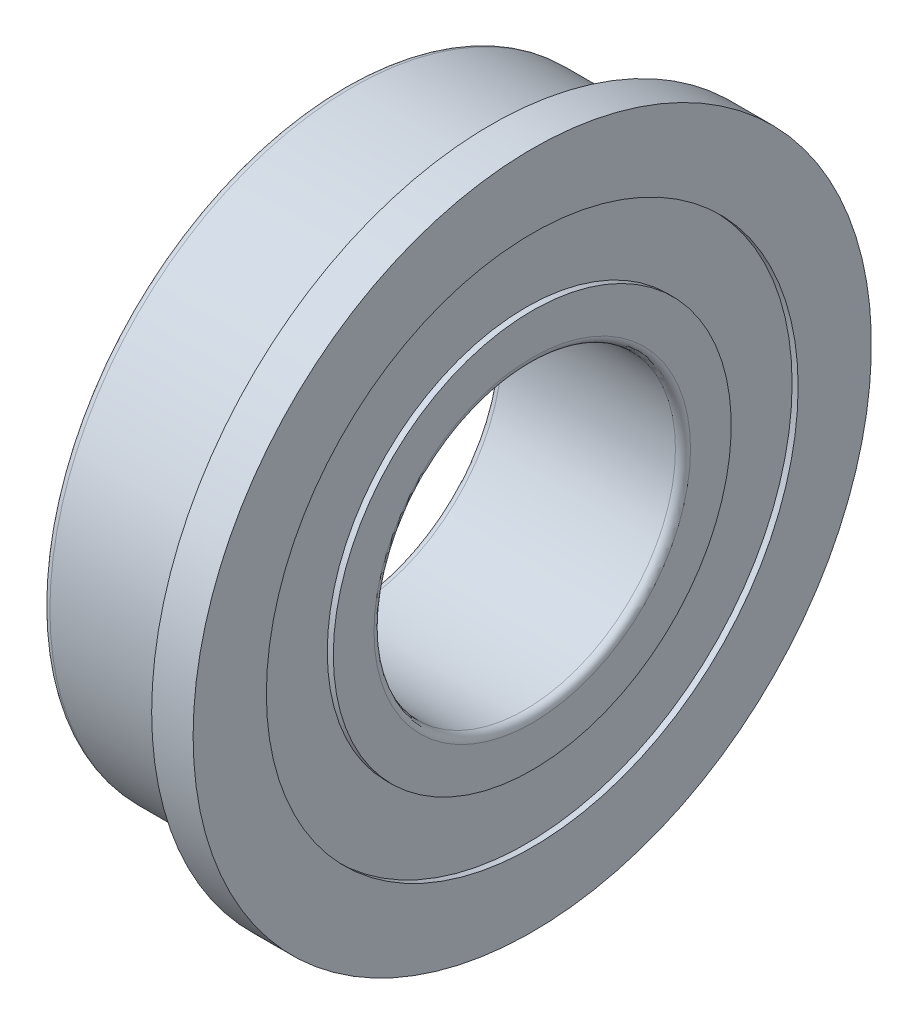
ISO-10303-21;
HEADER;
FILE_DESCRIPTION(('STEP AP214'),'2;1');
FILE_NAME('part.step','',(''),(''),'','','');
FILE_SCHEMA(('AUTOMOTIVE_DESIGN { 1 0 10303 214 1 1 1 1 }'));
ENDSEC;
DATA;
#1=APPLICATION_CONTEXT('core data for automotive mechanical design processes');
#2=APPLICATION_PROTOCOL_DEFINITION('international standard','automotive_design',2000,#1);
#3=PRODUCT_CONTEXT('',#1,'mechanical');
#4=PRODUCT('Part','Part','',(#3));
#5=PRODUCT_RELATED_PRODUCT_CATEGORY('part','',(#4));
#6=PRODUCT_DEFINITION_FORMATION('','',#4);
#7=PRODUCT_DEFINITION_CONTEXT('part definition',#1,'design');
#8=PRODUCT_DEFINITION('design','',#6,#7);
#9=PRODUCT_DEFINITION_SHAPE('','',#8);
#10=(LENGTH_UNIT() NAMED_UNIT(*) SI_UNIT(.MILLI.,.METRE.));
#11=(NAMED_UNIT(*) PLANE_ANGLE_UNIT() SI_UNIT($,.RADIAN.));
#12=(NAMED_UNIT(*) SI_UNIT($,.STERADIAN.) SOLID_ANGLE_UNIT());
#13=UNCERTAINTY_MEASURE_WITH_UNIT(LENGTH_MEASURE(1.E-05),#10,'distance_accuracy_value','');
#14=(GEOMETRIC_REPRESENTATION_CONTEXT(3) GLOBAL_UNCERTAINTY_ASSIGNED_CONTEXT((#13)) GLOBAL_UNIT_ASSIGNED_CONTEXT((#10,
#11,#12)) REPRESENTATION_CONTEXT('',''));
#15=CARTESIAN_POINT('',(0.,0.,0.));
#16=DIRECTION('',(0.,0.,1.));
#17=DIRECTION('',(1.,0.,0.));
#18=AXIS2_PLACEMENT_3D('',#15,#16,#17);
#19=CARTESIAN_POINT('',(0.,-5.35122517363639,-5.28));
#20=DIRECTION('',(-1.,0.,0.));
#21=DIRECTION('',(0.,0.,1.));
#22=AXIS2_PLACEMENT_3D('',#19,#20,#21);
#23=PLANE('',#22);
#24=CARTESIAN_POINT('',(0.,0.,0.));
#25=DIRECTION('',(-1.,0.,0.));
#26=DIRECTION('',(0.,0.,-1.));
#27=AXIS2_PLACEMENT_3D('',#24,#25,#26);
#28=CIRCLE('',#27,5.28);
#29=CARTESIAN_POINT('',(0.,0.,-5.28));
#30=VERTEX_POINT('',#29);
#31=EDGE_CURVE('E92',#30,#30,#28,.F.);
#32=ORIENTED_EDGE('',*,*,#31,.F.);
#33=EDGE_LOOP('',(#32));
#34=FACE_BOUND('',#33,.T.);
#35=CARTESIAN_POINT('',(0.,0.,0.));
#36=DIRECTION('',(1.,0.,0.));
#37=DIRECTION('',(0.,0.,1.));
#38=AXIS2_PLACEMENT_3D('',#35,#36,#37);
#39=CIRCLE('',#38,4.2);
#40=CARTESIAN_POINT('',(0.,0.,4.2));
#41=VERTEX_POINT('',#40);
#42=EDGE_CURVE('E88',#41,#41,#39,.T.);
#43=ORIENTED_EDGE('',*,*,#42,.T.);
#44=EDGE_LOOP('',(#43));
#45=FACE_BOUND('',#44,.T.);
#46=ADVANCED_FACE('F15',(#34,#45),#23,.T.);
#47=CARTESIAN_POINT('',(5.,-5.35122517363636,5.28));
#48=DIRECTION('',(1.,0.,0.));
#49=DIRECTION('',(0.,0.,-1.));
#50=AXIS2_PLACEMENT_3D('',#47,#48,#49);
#51=PLANE('',#50);
#52=CARTESIAN_POINT('',(5.,0.,0.));
#53=DIRECTION('',(1.,0.,0.));
#54=DIRECTION('',(0.,0.,1.));
#55=AXIS2_PLACEMENT_3D('',#52,#53,#54);
#56=CIRCLE('',#55,5.28);
#57=CARTESIAN_POINT('',(5.,0.,5.28));
#58=VERTEX_POINT('',#57);
#59=EDGE_CURVE('E84',#58,#58,#56,.T.);
#60=ORIENTED_EDGE('',*,*,#59,.T.);
#61=EDGE_LOOP('',(#60));
#62=FACE_BOUND('',#61,.T.);
#63=CARTESIAN_POINT('',(5.,0.,0.));
#64=DIRECTION('',(-1.,0.,0.));
#65=DIRECTION('',(0.,0.,-1.));
#66=AXIS2_PLACEMENT_3D('',#63,#64,#65);
#67=CIRCLE('',#66,4.20000011099115);
#68=CARTESIAN_POINT('',(5.,0.,-4.20000011099115));
#69=VERTEX_POINT('',#68);
#70=EDGE_CURVE('E80',#69,#69,#67,.F.);
#71=ORIENTED_EDGE('',*,*,#70,.F.);
#72=EDGE_LOOP('',(#71));
#73=FACE_BOUND('',#72,.T.);
#74=ADVANCED_FACE('F101',(#62,#73),#51,.T.);
#75=CARTESIAN_POINT('',(4.84,-7.24879784524055,7.056));
#76=DIRECTION('',(1.,0.,0.));
#77=DIRECTION('',(0.,0.,-1.));
#78=AXIS2_PLACEMENT_3D('',#75,#76,#77);
#79=PLANE('',#78);
#80=CARTESIAN_POINT('',(4.84,0.,0.));
#81=DIRECTION('',(1.,0.,0.));
#82=DIRECTION('',(0.,0.,1.));
#83=AXIS2_PLACEMENT_3D('',#80,#81,#82);
#84=CIRCLE('',#83,7.056);
#85=CARTESIAN_POINT('',(4.84,0.,7.056));
#86=VERTEX_POINT('',#85);
#87=EDGE_CURVE('E76',#86,#86,#84,.T.);
#88=ORIENTED_EDGE('',*,*,#87,.T.);
#89=EDGE_LOOP('',(#88));
#90=FACE_BOUND('',#89,.T.);
#91=CARTESIAN_POINT('',(4.84,0.,0.));
#92=DIRECTION('',(-1.,0.,0.));
#93=DIRECTION('',(0.,0.,-1.));
#94=AXIS2_PLACEMENT_3D('',#91,#92,#93);
#95=CIRCLE('',#94,5.28);
#96=CARTESIAN_POINT('',(4.84,0.,-5.28));
#97=VERTEX_POINT('',#96);
#98=EDGE_CURVE('E72',#97,#97,#95,.F.);
#99=ORIENTED_EDGE('',*,*,#98,.F.);
#100=EDGE_LOOP('',(#99));
#101=FACE_BOUND('',#100,.T.);
#102=ADVANCED_FACE('F169',(#90,#101),#79,.T.);
#103=CARTESIAN_POINT('',(5.,-9.24591561892927,9.));
#104=DIRECTION('',(1.,0.,0.));
#105=DIRECTION('',(0.,0.,-1.));
#106=AXIS2_PLACEMENT_3D('',#103,#104,#105);
#107=PLANE('',#106);
#108=CARTESIAN_POINT('',(5.,0.,0.));
#109=DIRECTION('',(1.,0.,0.));
#110=DIRECTION('',(0.,0.,1.));
#111=AXIS2_PLACEMENT_3D('',#108,#109,#110);
#112=CIRCLE('',#111,9.);
#113=CARTESIAN_POINT('',(5.,0.,9.));
#114=VERTEX_POINT('',#113);
#115=EDGE_CURVE('E68',#114,#114,#112,.T.);
#116=ORIENTED_EDGE('',*,*,#115,.T.);
#117=EDGE_LOOP('',(#116));
#118=FACE_BOUND('',#117,.T.);
#119=CARTESIAN_POINT('',(5.,0.,0.));
#120=DIRECTION('',(-1.,0.,0.));
#121=DIRECTION('',(0.,0.,-1.));
#122=AXIS2_PLACEMENT_3D('',#119,#120,#121);
#123=CIRCLE('',#122,7.056);
#124=CARTESIAN_POINT('',(5.,0.,-7.056));
#125=VERTEX_POINT('',#124);
#126=EDGE_CURVE('E64',#125,#125,#123,.F.);
#127=ORIENTED_EDGE('',*,*,#126,.F.);
#128=EDGE_LOOP('',(#127));
#129=FACE_BOUND('',#128,.T.);
#130=ADVANCED_FACE('F162',(#118,#129),#107,.T.);
#131=CARTESIAN_POINT('',(3.9,-9.24591561892927,-9.));
#132=DIRECTION('',(-1.,0.,0.));
#133=DIRECTION('',(0.,0.,1.));
#134=AXIS2_PLACEMENT_3D('',#131,#132,#133);
#135=PLANE('',#134);
#136=CARTESIAN_POINT('',(3.9,0.,0.));
#137=DIRECTION('',(-1.,0.,0.));
#138=DIRECTION('',(0.,0.,-1.));
#139=AXIS2_PLACEMENT_3D('',#136,#137,#138);
#140=CIRCLE('',#139,9.);
#141=CARTESIAN_POINT('',(3.9,0.,-9.));
#142=VERTEX_POINT('',#141);
#143=EDGE_CURVE('E60',#142,#142,#140,.F.);
#144=ORIENTED_EDGE('',*,*,#143,.F.);
#145=EDGE_LOOP('',(#144));
#146=FACE_BOUND('',#145,.T.);
#147=CARTESIAN_POINT('',(3.9,0.,0.));
#148=DIRECTION('',(1.,0.,0.));
#149=DIRECTION('',(0.,0.,1.));
#150=AXIS2_PLACEMENT_3D('',#147,#148,#149);
#151=CIRCLE('',#150,8.19999999999999);
#152=CARTESIAN_POINT('',(3.9,0.,8.19999999999999));
#153=VERTEX_POINT('',#152);
#154=EDGE_CURVE('E56',#153,#153,#151,.T.);
#155=ORIENTED_EDGE('',*,*,#154,.T.);
#156=EDGE_LOOP('',(#155));
#157=FACE_BOUND('',#156,.T.);
#158=ADVANCED_FACE('F158',(#146,#157),#135,.T.);
#159=CARTESIAN_POINT('',(0.,-8.0131268697387,-7.8));
#160=DIRECTION('',(-1.,0.,0.));
#161=DIRECTION('',(0.,0.,1.));
#162=AXIS2_PLACEMENT_3D('',#159,#160,#161);
#163=PLANE('',#162);
#164=CARTESIAN_POINT('',(0.,0.,0.));
#165=DIRECTION('',(-1.,0.,0.));
#166=DIRECTION('',(0.,0.,-1.));
#167=AXIS2_PLACEMENT_3D('',#164,#165,#166);
#168=CIRCLE('',#167,7.8);
#169=CARTESIAN_POINT('',(0.,0.,-7.8));
#170=VERTEX_POINT('',#169);
#171=EDGE_CURVE('E52',#170,#170,#168,.F.);
#172=ORIENTED_EDGE('',*,*,#171,.F.);
#173=EDGE_LOOP('',(#172));
#174=FACE_BOUND('',#173,.T.);
#175=CARTESIAN_POINT('',(0.,0.,0.));
#176=DIRECTION('',(1.,0.,0.));
#177=DIRECTION('',(0.,0.,1.));
#178=AXIS2_PLACEMENT_3D('',#175,#176,#177);
#179=CIRCLE('',#178,7.056);
#180=CARTESIAN_POINT('',(0.,0.,7.056));
#181=VERTEX_POINT('',#180);
#182=EDGE_CURVE('E48',#181,#181,#179,.T.);
#183=ORIENTED_EDGE('',*,*,#182,.T.);
#184=EDGE_LOOP('',(#183));
#185=FACE_BOUND('',#184,.T.);
#186=ADVANCED_FACE('F118',(#174,#185),#163,.T.);
#187=CARTESIAN_POINT('',(0.16,-7.24879784524055,-7.056));
#188=DIRECTION('',(-1.,0.,0.));
#189=DIRECTION('',(0.,0.,1.));
#190=AXIS2_PLACEMENT_3D('',#187,#188,#189);
#191=PLANE('',#190);
#192=CARTESIAN_POINT('',(0.16,0.,0.));
#193=DIRECTION('',(-1.,0.,0.));
#194=DIRECTION('',(0.,0.,-1.));
#195=AXIS2_PLACEMENT_3D('',#192,#193,#194);
#196=CIRCLE('',#195,7.056);
#197=CARTESIAN_POINT('',(0.16,0.,-7.056));
#198=VERTEX_POINT('',#197);
#199=EDGE_CURVE('E44',#198,#198,#196,.F.);
#200=ORIENTED_EDGE('',*,*,#199,.F.);
#201=EDGE_LOOP('',(#200));
#202=FACE_BOUND('',#201,.T.);
#203=CARTESIAN_POINT('',(0.16,0.,0.));
#204=DIRECTION('',(1.,0.,0.));
#205=DIRECTION('',(0.,0.,1.));
#206=AXIS2_PLACEMENT_3D('',#203,#204,#205);
#207=CIRCLE('',#206,5.28);
#208=CARTESIAN_POINT('',(0.16,0.,5.28));
#209=VERTEX_POINT('',#208);
#210=EDGE_CURVE('E40',#209,#209,#207,.T.);
#211=ORIENTED_EDGE('',*,*,#210,.T.);
#212=EDGE_LOOP('',(#211));
#213=FACE_BOUND('',#212,.T.);
#214=ADVANCED_FACE('F108',(#202,#213),#191,.T.);
#215=CARTESIAN_POINT('',(0.200000000000014,0.,0.));
#216=DIRECTION('',(1.,0.,0.));
#217=DIRECTION('',(0.,0.,1.));
#218=AXIS2_PLACEMENT_3D('',#215,#216,#217);
#219=TOROIDAL_SURFACE('',#218,4.2,0.200000000000014);
#220=CARTESIAN_POINT('',(0.2,0.,0.));
#221=DIRECTION('',(1.,0.,0.));
#222=DIRECTION('',(0.,0.,1.));
#223=AXIS2_PLACEMENT_3D('',#220,#221,#222);
#224=CIRCLE('',#223,3.99999999999999);
#225=CARTESIAN_POINT('',(0.2,0.,3.99999999999999));
#226=VERTEX_POINT('',#225);
#227=EDGE_CURVE('E34',#226,#226,#224,.T.);
#228=ORIENTED_EDGE('',*,*,#227,.T.);
#229=EDGE_LOOP('',(#228));
#230=FACE_BOUND('',#229,.T.);
#231=ORIENTED_EDGE('',*,*,#42,.F.);
#232=EDGE_LOOP('',(#231));
#233=FACE_BOUND('',#232,.T.);
#234=ADVANCED_FACE('F105',(#230,#233),#219,.T.);
#235=CARTESIAN_POINT('',(16.,0.,0.));
#236=DIRECTION('',(1.,0.,0.));
#237=DIRECTION('',(0.,0.,1.));
#238=AXIS2_PLACEMENT_3D('',#235,#236,#237);
#239=CYLINDRICAL_SURFACE('',#238,4.);
#240=CARTESIAN_POINT('',(4.8,0.,0.));
#241=DIRECTION('',(1.,0.,0.));
#242=DIRECTION('',(0.,0.,1.));
#243=AXIS2_PLACEMENT_3D('',#240,#241,#242);
#244=CIRCLE('',#243,4.);
#245=CARTESIAN_POINT('',(4.8,0.,4.));
#246=VERTEX_POINT('',#245);
#247=EDGE_CURVE('E29',#246,#246,#244,.T.);
#248=ORIENTED_EDGE('',*,*,#247,.T.);
#249=EDGE_LOOP('',(#248));
#250=FACE_BOUND('',#249,.T.);
#251=ORIENTED_EDGE('',*,*,#227,.F.);
#252=EDGE_LOOP('',(#251));
#253=FACE_BOUND('',#252,.T.);
#254=ADVANCED_FACE('F107',(#250,#253),#239,.F.);
#255=CARTESIAN_POINT('',(4.8,0.,0.));
#256=DIRECTION('',(1.,0.,0.));
#257=DIRECTION('',(0.,0.,1.));
#258=AXIS2_PLACEMENT_3D('',#255,#256,#257);
#259=TOROIDAL_SURFACE('',#258,4.2,0.200000000000031);
#260=ORIENTED_EDGE('',*,*,#70,.T.);
#261=EDGE_LOOP('',(#260));
#262=FACE_BOUND('',#261,.T.);
#263=ORIENTED_EDGE('',*,*,#247,.F.);
#264=EDGE_LOOP('',(#263));
#265=FACE_BOUND('',#264,.T.);
#266=ADVANCED_FACE('F115',(#262,#265),#259,.T.);
#267=CARTESIAN_POINT('',(16.,0.,0.));
#268=DIRECTION('',(1.,0.,0.));
#269=DIRECTION('',(0.,1.42053905649926E-07,0.99999999999999));
#270=AXIS2_PLACEMENT_3D('',#267,#268,#269);
#271=CYLINDRICAL_SURFACE('',#270,5.28);
#272=ORIENTED_EDGE('',*,*,#98,.T.);
#273=EDGE_LOOP('',(#272));
#274=FACE_BOUND('',#273,.T.);
#275=ORIENTED_EDGE('',*,*,#59,.F.);
#276=EDGE_LOOP('',(#275));
#277=FACE_BOUND('',#276,.T.);
#278=ADVANCED_FACE('F125',(#274,#277),#271,.T.);
#279=CARTESIAN_POINT('',(16.,0.,0.));
#280=DIRECTION('',(1.,0.,0.));
#281=DIRECTION('',(0.,0.,1.));
#282=AXIS2_PLACEMENT_3D('',#279,#280,#281);
#283=CYLINDRICAL_SURFACE('',#282,7.056);
#284=ORIENTED_EDGE('',*,*,#126,.T.);
#285=EDGE_LOOP('',(#284));
#286=FACE_BOUND('',#285,.T.);
#287=ORIENTED_EDGE('',*,*,#87,.F.);
#288=EDGE_LOOP('',(#287));
#289=FACE_BOUND('',#288,.T.);
#290=ADVANCED_FACE('F129',(#286,#289),#283,.F.);
#291=CARTESIAN_POINT('',(16.,0.,0.));
#292=DIRECTION('',(1.,0.,0.));
#293=DIRECTION('',(0.,0.,1.));
#294=AXIS2_PLACEMENT_3D('',#291,#292,#293);
#295=CYLINDRICAL_SURFACE('',#294,9.);
#296=ORIENTED_EDGE('',*,*,#143,.T.);
#297=EDGE_LOOP('',(#296));
#298=FACE_BOUND('',#297,.T.);
#299=ORIENTED_EDGE('',*,*,#115,.F.);
#300=EDGE_LOOP('',(#299));
#301=FACE_BOUND('',#300,.T.);
#302=ADVANCED_FACE('F133',(#298,#301),#295,.T.);
#303=CARTESIAN_POINT('',(3.9,0.,0.));
#304=DIRECTION('',(1.,0.,0.));
#305=DIRECTION('',(0.,0.,1.));
#306=AXIS2_PLACEMENT_3D('',#303,#304,#305);
#307=TOROIDAL_SURFACE('',#306,8.,0.199999999999994);
#308=ORIENTED_EDGE('',*,*,#154,.F.);
#309=EDGE_LOOP('',(#308));
#310=FACE_BOUND('',#309,.T.);
#311=CARTESIAN_POINT('',(3.70000000000001,0.,0.));
#312=DIRECTION('',(1.,0.,0.));
#313=DIRECTION('',(0.,0.,1.));
#314=AXIS2_PLACEMENT_3D('',#311,#312,#313);
#315=CIRCLE('',#314,8.);
#316=CARTESIAN_POINT('',(3.70000000000001,0.,8.));
#317=VERTEX_POINT('',#316);
#318=EDGE_CURVE('E23',#317,#317,#315,.T.);
#319=ORIENTED_EDGE('',*,*,#318,.T.);
#320=EDGE_LOOP('',(#319));
#321=FACE_BOUND('',#320,.T.);
#322=ADVANCED_FACE('F137',(#310,#321),#307,.F.);
#323=CARTESIAN_POINT('',(16.,0.,0.));
#324=DIRECTION('',(1.,0.,0.));
#325=DIRECTION('',(0.,0.,1.));
#326=AXIS2_PLACEMENT_3D('',#323,#324,#325);
#327=CYLINDRICAL_SURFACE('',#326,8.);
#328=CARTESIAN_POINT('',(0.199999999999999,0.,0.));
#329=DIRECTION('',(1.,0.,0.));
#330=DIRECTION('',(0.,0.,1.));
#331=AXIS2_PLACEMENT_3D('',#328,#329,#330);
#332=CIRCLE('',#331,8.);
#333=CARTESIAN_POINT('',(0.199999999999999,0.,8.));
#334=VERTEX_POINT('',#333);
#335=EDGE_CURVE('E10',#334,#334,#332,.T.);
#336=ORIENTED_EDGE('',*,*,#335,.T.);
#337=EDGE_LOOP('',(#336));
#338=FACE_BOUND('',#337,.T.);
#339=ORIENTED_EDGE('',*,*,#318,.F.);
#340=EDGE_LOOP('',(#339));
#341=FACE_BOUND('',#340,.T.);
#342=ADVANCED_FACE('F141',(#338,#341),#327,.T.);
#343=CARTESIAN_POINT('',(0.200000000000016,0.,0.));
#344=DIRECTION('',(1.,0.,0.));
#345=DIRECTION('',(0.,0.,1.));
#346=AXIS2_PLACEMENT_3D('',#343,#344,#345);
#347=TOROIDAL_SURFACE('',#346,7.8,0.200000000000014);
#348=ORIENTED_EDGE('',*,*,#171,.T.);
#349=EDGE_LOOP('',(#348));
#350=FACE_BOUND('',#349,.T.);
#351=ORIENTED_EDGE('',*,*,#335,.F.);
#352=EDGE_LOOP('',(#351));
#353=FACE_BOUND('',#352,.T.);
#354=ADVANCED_FACE('F145',(#350,#353),#347,.T.);
#355=CARTESIAN_POINT('',(16.,0.,0.));
#356=DIRECTION('',(1.,0.,0.));
#357=DIRECTION('',(0.,0.,1.));
#358=AXIS2_PLACEMENT_3D('',#355,#356,#357);
#359=CYLINDRICAL_SURFACE('',#358,7.056);
#360=ORIENTED_EDGE('',*,*,#199,.T.);
#361=EDGE_LOOP('',(#360));
#362=FACE_BOUND('',#361,.T.);
#363=ORIENTED_EDGE('',*,*,#182,.F.);
#364=EDGE_LOOP('',(#363));
#365=FACE_BOUND('',#364,.T.);
#366=ADVANCED_FACE('F147',(#362,#365),#359,.F.);
#367=CARTESIAN_POINT('',(16.,0.,0.));
#368=DIRECTION('',(1.,0.,0.));
#369=DIRECTION('',(0.,1.42331256236867E-07,0.99999999999999));
#370=AXIS2_PLACEMENT_3D('',#367,#368,#369);
#371=CYLINDRICAL_SURFACE('',#370,5.28);
#372=ORIENTED_EDGE('',*,*,#31,.T.);
#373=EDGE_LOOP('',(#372));
#374=FACE_BOUND('',#373,.T.);
#375=ORIENTED_EDGE('',*,*,#210,.F.);
#376=EDGE_LOOP('',(#375));
#377=FACE_BOUND('',#376,.T.);
#378=ADVANCED_FACE('F17',(#374,#377),#371,.T.);
#379=CLOSED_SHELL('',(#46,#74,#102,#130,#158,#186,#214,#234,#254,#266,#278,#290,#302,#322,#342,
#354,#366,#378));
#380=MANIFOLD_SOLID_BREP('B1',#379);
#381=ADVANCED_BREP_SHAPE_REPRESENTATION('',(#18,#380),#14);
#382=SHAPE_DEFINITION_REPRESENTATION(#9,#381);
ENDSEC;
END-ISO-10303-21;
